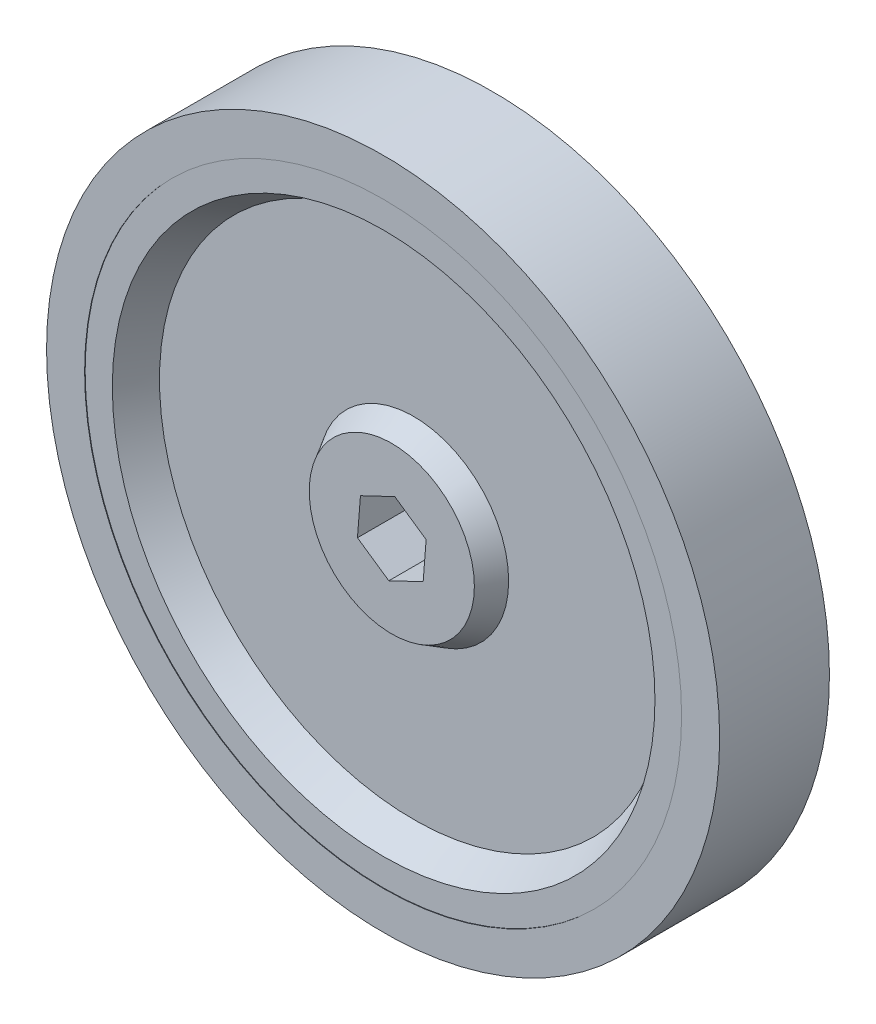
ISO-10303-21;
HEADER;
FILE_DESCRIPTION(('STEP AP214'),'2;1');
FILE_NAME('part.step','',(''),(''),'','','');
FILE_SCHEMA(('AUTOMOTIVE_DESIGN { 1 0 10303 214 1 1 1 1 }'));
ENDSEC;
DATA;
#1=APPLICATION_CONTEXT('core data for automotive mechanical design processes');
#2=APPLICATION_PROTOCOL_DEFINITION('international standard','automotive_design',2000,#1);
#3=PRODUCT_CONTEXT('',#1,'mechanical');
#4=PRODUCT('Part','Part','',(#3));
#5=PRODUCT_RELATED_PRODUCT_CATEGORY('part','',(#4));
#6=PRODUCT_DEFINITION_FORMATION('','',#4);
#7=PRODUCT_DEFINITION_CONTEXT('part definition',#1,'design');
#8=PRODUCT_DEFINITION('design','',#6,#7);
#9=PRODUCT_DEFINITION_SHAPE('','',#8);
#10=(LENGTH_UNIT() NAMED_UNIT(*) SI_UNIT(.MILLI.,.METRE.));
#11=(NAMED_UNIT(*) PLANE_ANGLE_UNIT() SI_UNIT($,.RADIAN.));
#12=(NAMED_UNIT(*) SI_UNIT($,.STERADIAN.) SOLID_ANGLE_UNIT());
#13=UNCERTAINTY_MEASURE_WITH_UNIT(LENGTH_MEASURE(1.E-05),#10,'distance_accuracy_value','');
#14=(GEOMETRIC_REPRESENTATION_CONTEXT(3) GLOBAL_UNCERTAINTY_ASSIGNED_CONTEXT((#13)) GLOBAL_UNIT_ASSIGNED_CONTEXT((#10,
#11,#12)) REPRESENTATION_CONTEXT('',''));
#15=CARTESIAN_POINT('',(0.,0.,0.));
#16=DIRECTION('',(0.,0.,1.));
#17=DIRECTION('',(1.,0.,0.));
#18=AXIS2_PLACEMENT_3D('',#15,#16,#17);
#19=CARTESIAN_POINT('',(0.,0.,-4.5));
#20=DIRECTION('',(0.,0.,-1.));
#21=DIRECTION('',(-1.,0.,0.));
#22=AXIS2_PLACEMENT_3D('',#19,#20,#21);
#23=PLANE('',#22);
#24=CARTESIAN_POINT('',(0.,0.,-4.5));
#25=DIRECTION('',(0.,0.,-1.));
#26=DIRECTION('',(-1.,0.,0.));
#27=AXIS2_PLACEMENT_3D('',#24,#25,#26);
#28=CIRCLE('',#27,46.737073519457);
#29=CARTESIAN_POINT('',(-46.737073519457,0.,-4.5));
#30=VERTEX_POINT('',#29);
#31=EDGE_CURVE('E164',#30,#30,#28,.T.);
#32=ORIENTED_EDGE('',*,*,#31,.T.);
#33=EDGE_LOOP('',(#32));
#34=FACE_BOUND('',#33,.T.);
#35=CARTESIAN_POINT('',(0.,0.,-4.5));
#36=DIRECTION('',(0.,0.,-1.));
#37=DIRECTION('',(-1.,0.,0.));
#38=AXIS2_PLACEMENT_3D('',#35,#36,#37);
#39=CIRCLE('',#38,17.5);
#40=CARTESIAN_POINT('',(-17.5,0.,-4.5));
#41=VERTEX_POINT('',#40);
#42=EDGE_CURVE('E149',#41,#41,#39,.T.);
#43=ORIENTED_EDGE('',*,*,#42,.F.);
#44=EDGE_LOOP('',(#43));
#45=FACE_BOUND('',#44,.T.);
#46=ADVANCED_FACE('F46',(#34,#45),#23,.T.);
#47=CARTESIAN_POINT('',(0.,0.,4.5));
#48=DIRECTION('',(0.,0.,1.));
#49=DIRECTION('',(1.,0.,0.));
#50=AXIS2_PLACEMENT_3D('',#47,#48,#49);
#51=PLANE('',#50);
#52=CARTESIAN_POINT('',(0.,0.,4.5));
#53=DIRECTION('',(0.,0.,1.));
#54=DIRECTION('',(1.,0.,0.));
#55=AXIS2_PLACEMENT_3D('',#52,#53,#54);
#56=CIRCLE('',#55,46.737073519457);
#57=CARTESIAN_POINT('',(46.737073519457,0.,4.5));
#58=VERTEX_POINT('',#57);
#59=EDGE_CURVE('E54',#58,#58,#56,.T.);
#60=ORIENTED_EDGE('',*,*,#59,.T.);
#61=EDGE_LOOP('',(#60));
#62=FACE_BOUND('',#61,.T.);
#63=CARTESIAN_POINT('',(0.,0.,4.5));
#64=DIRECTION('',(0.,0.,1.));
#65=DIRECTION('',(1.,0.,0.));
#66=AXIS2_PLACEMENT_3D('',#63,#64,#65);
#67=CIRCLE('',#66,17.5);
#68=CARTESIAN_POINT('',(17.5,0.,4.5));
#69=VERTEX_POINT('',#68);
#70=EDGE_CURVE('E155',#69,#69,#67,.T.);
#71=ORIENTED_EDGE('',*,*,#70,.F.);
#72=EDGE_LOOP('',(#71));
#73=FACE_BOUND('',#72,.T.);
#74=ADVANCED_FACE('F172',(#62,#73),#51,.T.);
#75=CARTESIAN_POINT('',(0.,0.,10.));
#76=DIRECTION('',(0.,0.,-1.));
#77=DIRECTION('',(-1.,0.,0.));
#78=AXIS2_PLACEMENT_3D('',#75,#76,#77);
#79=CYLINDRICAL_SURFACE('',#78,61.9125);
#80=CARTESIAN_POINT('',(0.,0.,10.1));
#81=DIRECTION('',(0.,0.,1.));
#82=DIRECTION('',(1.,0.,0.));
#83=AXIS2_PLACEMENT_3D('',#80,#81,#82);
#84=CIRCLE('',#83,61.9125);
#85=CARTESIAN_POINT('',(61.9125,0.,10.1));
#86=VERTEX_POINT('',#85);
#87=EDGE_CURVE('E287',#86,#86,#84,.T.);
#88=ORIENTED_EDGE('',*,*,#87,.F.);
#89=EDGE_LOOP('',(#88));
#90=FACE_BOUND('',#89,.T.);
#91=CARTESIAN_POINT('',(0.,0.,-10.1));
#92=DIRECTION('',(0.,0.,-1.));
#93=DIRECTION('',(-1.,0.,0.));
#94=AXIS2_PLACEMENT_3D('',#91,#92,#93);
#95=CIRCLE('',#94,61.9125);
#96=CARTESIAN_POINT('',(-61.9125,0.,-10.1));
#97=VERTEX_POINT('',#96);
#98=EDGE_CURVE('E279',#97,#97,#95,.T.);
#99=ORIENTED_EDGE('',*,*,#98,.F.);
#100=EDGE_LOOP('',(#99));
#101=FACE_BOUND('',#100,.T.);
#102=ADVANCED_FACE('F48',(#90,#101),#79,.T.);
#103=CARTESIAN_POINT('',(0.,0.,10.));
#104=DIRECTION('',(0.,0.,1.));
#105=DIRECTION('',(1.,0.,0.));
#106=AXIS2_PLACEMENT_3D('',#103,#104,#105);
#107=PLANE('',#106);
#108=CARTESIAN_POINT('',(0.,0.,10.));
#109=DIRECTION('',(0.,0.,1.));
#110=DIRECTION('',(1.,0.,0.));
#111=AXIS2_PLACEMENT_3D('',#108,#109,#110);
#112=CIRCLE('',#111,54.9125);
#113=CARTESIAN_POINT('',(54.9125,0.,10.));
#114=VERTEX_POINT('',#113);
#115=EDGE_CURVE('E12',#114,#114,#112,.F.);
#116=ORIENTED_EDGE('',*,*,#115,.F.);
#117=EDGE_LOOP('',(#116));
#118=FACE_BOUND('',#117,.T.);
#119=CARTESIAN_POINT('',(0.,0.,10.));
#120=DIRECTION('',(0.,0.,1.));
#121=DIRECTION('',(1.,0.,0.));
#122=AXIS2_PLACEMENT_3D('',#119,#120,#121);
#123=CIRCLE('',#122,49.9125);
#124=CARTESIAN_POINT('',(49.9125,0.,10.));
#125=VERTEX_POINT('',#124);
#126=EDGE_CURVE('E167',#125,#125,#123,.T.);
#127=ORIENTED_EDGE('',*,*,#126,.F.);
#128=EDGE_LOOP('',(#127));
#129=FACE_BOUND('',#128,.T.);
#130=ADVANCED_FACE('F183',(#118,#129),#107,.T.);
#131=CARTESIAN_POINT('',(0.,0.,-10.));
#132=DIRECTION('',(0.,0.,1.));
#133=DIRECTION('',(1.,0.,0.));
#134=AXIS2_PLACEMENT_3D('',#131,#132,#133);
#135=PLANE('',#134);
#136=CARTESIAN_POINT('',(0.,0.,-10.));
#137=DIRECTION('',(0.,0.,-1.));
#138=DIRECTION('',(-1.,0.,0.));
#139=AXIS2_PLACEMENT_3D('',#136,#137,#138);
#140=CIRCLE('',#139,54.9125);
#141=CARTESIAN_POINT('',(-54.9125,0.,-10.));
#142=VERTEX_POINT('',#141);
#143=EDGE_CURVE('E277',#142,#142,#140,.T.);
#144=ORIENTED_EDGE('',*,*,#143,.T.);
#145=EDGE_LOOP('',(#144));
#146=FACE_BOUND('',#145,.T.);
#147=CARTESIAN_POINT('',(0.,0.,-10.));
#148=DIRECTION('',(0.,0.,-1.));
#149=DIRECTION('',(-1.,0.,0.));
#150=AXIS2_PLACEMENT_3D('',#147,#148,#149);
#151=CIRCLE('',#150,49.9125);
#152=CARTESIAN_POINT('',(-49.9125,0.,-10.));
#153=VERTEX_POINT('',#152);
#154=EDGE_CURVE('E161',#153,#153,#151,.T.);
#155=ORIENTED_EDGE('',*,*,#154,.F.);
#156=EDGE_LOOP('',(#155));
#157=FACE_BOUND('',#156,.T.);
#158=ADVANCED_FACE('F179',(#146,#157),#135,.F.);
#159=CARTESIAN_POINT('',(0.,0.,10.));
#160=DIRECTION('',(0.,0.,1.));
#161=DIRECTION('',(1.,0.,0.));
#162=AXIS2_PLACEMENT_3D('',#159,#160,#161);
#163=CONICAL_SURFACE('',#162,49.9125,0.5235987755983);
#164=ORIENTED_EDGE('',*,*,#59,.F.);
#165=EDGE_LOOP('',(#164));
#166=FACE_BOUND('',#165,.T.);
#167=ORIENTED_EDGE('',*,*,#126,.T.);
#168=EDGE_LOOP('',(#167));
#169=FACE_BOUND('',#168,.T.);
#170=ADVANCED_FACE('F175',(#166,#169),#163,.F.);
#171=CARTESIAN_POINT('',(0.,0.,-10.));
#172=DIRECTION('',(0.,0.,-1.));
#173=DIRECTION('',(-1.,0.,0.));
#174=AXIS2_PLACEMENT_3D('',#171,#172,#173);
#175=CONICAL_SURFACE('',#174,49.9125,0.5235987755983);
#176=ORIENTED_EDGE('',*,*,#31,.F.);
#177=EDGE_LOOP('',(#176));
#178=FACE_BOUND('',#177,.T.);
#179=ORIENTED_EDGE('',*,*,#154,.T.);
#180=EDGE_LOOP('',(#179));
#181=FACE_BOUND('',#180,.T.);
#182=ADVANCED_FACE('F178',(#178,#181),#175,.F.);
#183=CARTESIAN_POINT('',(0.,0.,4.5));
#184=DIRECTION('',(0.,0.,-1.));
#185=DIRECTION('',(1.,0.,0.));
#186=AXIS2_PLACEMENT_3D('',#183,#184,#185);
#187=CONICAL_SURFACE('',#186,17.5,0.5235987755983);
#188=CARTESIAN_POINT('',(0.,0.,8.5));
#189=DIRECTION('',(0.,0.,1.));
#190=DIRECTION('',(1.,0.,0.));
#191=AXIS2_PLACEMENT_3D('',#188,#189,#190);
#192=CIRCLE('',#191,15.1905989232415);
#193=CARTESIAN_POINT('',(15.1905989232415,0.,8.5));
#194=VERTEX_POINT('',#193);
#195=EDGE_CURVE('E158',#194,#194,#192,.T.);
#196=ORIENTED_EDGE('',*,*,#195,.F.);
#197=EDGE_LOOP('',(#196));
#198=FACE_BOUND('',#197,.T.);
#199=ORIENTED_EDGE('',*,*,#70,.T.);
#200=EDGE_LOOP('',(#199));
#201=FACE_BOUND('',#200,.T.);
#202=ADVANCED_FACE('F204',(#198,#201),#187,.T.);
#203=CARTESIAN_POINT('',(0.,0.,8.5));
#204=DIRECTION('',(0.,0.,1.));
#205=DIRECTION('',(1.,0.,0.));
#206=AXIS2_PLACEMENT_3D('',#203,#204,#205);
#207=PLANE('',#206);
#208=DIRECTION('',(0.824168192044815,-0.56634511671028,0.));
#209=VECTOR('',#208,1.);
#210=CARTESIAN_POINT('',(-3.43328480866256,-4.99625413911331,8.5));
#211=LINE('',#210,#209);
#212=CARTESIAN_POINT('',(-6.31787348081941,-3.01404623062733,8.5));
#213=VERTEX_POINT('',#212);
#214=CARTESIAN_POINT('',(-0.548696136505699,-6.9784620475993,8.5));
#215=VERTEX_POINT('',#214);
#216=EDGE_CURVE('E147',#213,#215,#211,.T.);
#217=ORIENTED_EDGE('',*,*,#216,.F.);
#218=DIRECTION('',(-0.0783851623579575,-0.996923149657042,0.));
#219=VECTOR('',#218,1.);
#220=CARTESIAN_POINT('',(-6.04352541256656,0.475184793172313,8.5));
#221=LINE('',#220,#219);
#222=CARTESIAN_POINT('',(-5.76917734431371,3.96441581697196,8.5));
#223=VERTEX_POINT('',#222);
#224=EDGE_CURVE('E132',#223,#213,#221,.T.);
#225=ORIENTED_EDGE('',*,*,#224,.F.);
#226=DIRECTION('',(-0.902553354402773,-0.430578032946762,0.));
#227=VECTOR('',#226,1.);
#228=CARTESIAN_POINT('',(-2.61024060390401,5.47143893228563,8.5));
#229=LINE('',#228,#227);
#230=CARTESIAN_POINT('',(0.5486961365057,6.9784620475993,8.5));
#231=VERTEX_POINT('',#230);
#232=EDGE_CURVE('E105',#231,#223,#229,.T.);
#233=ORIENTED_EDGE('',*,*,#232,.F.);
#234=DIRECTION('',(-0.824168192044815,0.56634511671028,0.));
#235=VECTOR('',#234,1.);
#236=CARTESIAN_POINT('',(3.43328480866256,4.99625413911332,8.5));
#237=LINE('',#236,#235);
#238=CARTESIAN_POINT('',(6.31787348081941,3.01404623062734,8.5));
#239=VERTEX_POINT('',#238);
#240=EDGE_CURVE('E141',#239,#231,#237,.T.);
#241=ORIENTED_EDGE('',*,*,#240,.F.);
#242=DIRECTION('',(0.0783851623579574,0.996923149657042,0.));
#243=VECTOR('',#242,1.);
#244=CARTESIAN_POINT('',(6.04352541256656,-0.475184793172312,8.5));
#245=LINE('',#244,#243);
#246=CARTESIAN_POINT('',(5.76917734431371,-3.96441581697196,8.5));
#247=VERTEX_POINT('',#246);
#248=EDGE_CURVE('E143',#247,#239,#245,.T.);
#249=ORIENTED_EDGE('',*,*,#248,.F.);
#250=DIRECTION('',(0.902553354402773,0.430578032946762,0.));
#251=VECTOR('',#250,1.);
#252=CARTESIAN_POINT('',(2.61024060390401,-5.47143893228563,8.5));
#253=LINE('',#252,#251);
#254=EDGE_CURVE('E145',#215,#247,#253,.T.);
#255=ORIENTED_EDGE('',*,*,#254,.F.);
#256=EDGE_LOOP('',(#217,#225,#233,#241,#249,#255));
#257=FACE_BOUND('',#256,.T.);
#258=ORIENTED_EDGE('',*,*,#195,.T.);
#259=EDGE_LOOP('',(#258));
#260=FACE_BOUND('',#259,.T.);
#261=ADVANCED_FACE('F211',(#257,#260),#207,.T.);
#262=CARTESIAN_POINT('',(0.,0.,-4.5));
#263=DIRECTION('',(0.,0.,1.));
#264=DIRECTION('',(-1.,0.,0.));
#265=AXIS2_PLACEMENT_3D('',#262,#263,#264);
#266=CONICAL_SURFACE('',#265,17.5,0.5235987755983);
#267=CARTESIAN_POINT('',(0.,0.,-8.5));
#268=DIRECTION('',(0.,0.,-1.));
#269=DIRECTION('',(-1.,0.,0.));
#270=AXIS2_PLACEMENT_3D('',#267,#268,#269);
#271=CIRCLE('',#270,15.1905989232415);
#272=CARTESIAN_POINT('',(-15.1905989232415,0.,-8.5));
#273=VERTEX_POINT('',#272);
#274=EDGE_CURVE('E152',#273,#273,#271,.T.);
#275=ORIENTED_EDGE('',*,*,#274,.F.);
#276=EDGE_LOOP('',(#275));
#277=FACE_BOUND('',#276,.T.);
#278=ORIENTED_EDGE('',*,*,#42,.T.);
#279=EDGE_LOOP('',(#278));
#280=FACE_BOUND('',#279,.T.);
#281=ADVANCED_FACE('F220',(#277,#280),#266,.T.);
#282=CARTESIAN_POINT('',(0.,0.,-8.5));
#283=DIRECTION('',(0.,0.,-1.));
#284=DIRECTION('',(-1.,0.,0.));
#285=AXIS2_PLACEMENT_3D('',#282,#283,#284);
#286=PLANE('',#285);
#287=DIRECTION('',(-0.824168192044815,0.56634511671028,0.));
#288=VECTOR('',#287,1.);
#289=CARTESIAN_POINT('',(-0.548696136505699,-6.9784620475993,-8.5));
#290=LINE('',#289,#288);
#291=CARTESIAN_POINT('',(-0.548696136505699,-6.9784620475993,-8.5));
#292=VERTEX_POINT('',#291);
#293=CARTESIAN_POINT('',(-6.31787348081941,-3.01404623062733,-8.5));
#294=VERTEX_POINT('',#293);
#295=EDGE_CURVE('E69',#292,#294,#290,.T.);
#296=ORIENTED_EDGE('',*,*,#295,.F.);
#297=DIRECTION('',(-0.902553354402773,-0.430578032946762,0.));
#298=VECTOR('',#297,1.);
#299=CARTESIAN_POINT('',(5.76917734431371,-3.96441581697196,-8.5));
#300=LINE('',#299,#298);
#301=CARTESIAN_POINT('',(5.76917734431371,-3.96441581697196,-8.5));
#302=VERTEX_POINT('',#301);
#303=EDGE_CURVE('E127',#302,#292,#300,.T.);
#304=ORIENTED_EDGE('',*,*,#303,.F.);
#305=DIRECTION('',(-0.0783851623579574,-0.996923149657042,0.));
#306=VECTOR('',#305,1.);
#307=CARTESIAN_POINT('',(6.31787348081941,3.01404623062734,-8.5));
#308=LINE('',#307,#306);
#309=CARTESIAN_POINT('',(6.31787348081941,3.01404623062734,-8.5));
#310=VERTEX_POINT('',#309);
#311=EDGE_CURVE('E121',#310,#302,#308,.T.);
#312=ORIENTED_EDGE('',*,*,#311,.F.);
#313=DIRECTION('',(0.824168192044815,-0.56634511671028,0.));
#314=VECTOR('',#313,1.);
#315=CARTESIAN_POINT('',(0.5486961365057,6.9784620475993,-8.5));
#316=LINE('',#315,#314);
#317=CARTESIAN_POINT('',(0.5486961365057,6.9784620475993,-8.5));
#318=VERTEX_POINT('',#317);
#319=EDGE_CURVE('E119',#318,#310,#316,.T.);
#320=ORIENTED_EDGE('',*,*,#319,.F.);
#321=DIRECTION('',(0.902553354402773,0.430578032946762,0.));
#322=VECTOR('',#321,1.);
#323=CARTESIAN_POINT('',(-5.76917734431371,3.96441581697196,-8.5));
#324=LINE('',#323,#322);
#325=CARTESIAN_POINT('',(-5.76917734431371,3.96441581697196,-8.5));
#326=VERTEX_POINT('',#325);
#327=EDGE_CURVE('E102',#326,#318,#324,.T.);
#328=ORIENTED_EDGE('',*,*,#327,.F.);
#329=DIRECTION('',(0.0783851623579575,0.996923149657042,0.));
#330=VECTOR('',#329,1.);
#331=CARTESIAN_POINT('',(-6.31787348081941,-3.01404623062733,-8.5));
#332=LINE('',#331,#330);
#333=EDGE_CURVE('E111',#294,#326,#332,.T.);
#334=ORIENTED_EDGE('',*,*,#333,.F.);
#335=EDGE_LOOP('',(#296,#304,#312,#320,#328,#334));
#336=FACE_BOUND('',#335,.T.);
#337=ORIENTED_EDGE('',*,*,#274,.T.);
#338=EDGE_LOOP('',(#337));
#339=FACE_BOUND('',#338,.T.);
#340=ADVANCED_FACE('F115',(#336,#339),#286,.T.);
#341=CARTESIAN_POINT('',(-0.548696136505699,-6.9784620475993,15.5));
#342=DIRECTION('',(-0.56634511671028,-0.824168192044815,0.));
#343=DIRECTION('',(0.824168192044815,-0.56634511671028,0.));
#344=AXIS2_PLACEMENT_3D('',#341,#342,#343);
#345=PLANE('',#344);
#346=ORIENTED_EDGE('',*,*,#216,.T.);
#347=DIRECTION('',(0.,0.,-1.));
#348=VECTOR('',#347,1.);
#349=CARTESIAN_POINT('',(-0.548696136505699,-6.9784620475993,15.5));
#350=LINE('',#349,#348);
#351=EDGE_CURVE('E130',#215,#292,#350,.T.);
#352=ORIENTED_EDGE('',*,*,#351,.T.);
#353=ORIENTED_EDGE('',*,*,#295,.T.);
#354=DIRECTION('',(0.,0.,-1.));
#355=VECTOR('',#354,1.);
#356=CARTESIAN_POINT('',(-6.31787348081941,-3.01404623062733,15.5));
#357=LINE('',#356,#355);
#358=EDGE_CURVE('E108',#213,#294,#357,.T.);
#359=ORIENTED_EDGE('',*,*,#358,.F.);
#360=EDGE_LOOP('',(#346,#352,#353,#359));
#361=FACE_BOUND('',#360,.T.);
#362=ADVANCED_FACE('F235',(#361),#345,.F.);
#363=CARTESIAN_POINT('',(5.76917734431371,-3.96441581697196,15.5));
#364=DIRECTION('',(0.430578032946762,-0.902553354402773,0.));
#365=DIRECTION('',(0.902553354402773,0.430578032946762,0.));
#366=AXIS2_PLACEMENT_3D('',#363,#364,#365);
#367=PLANE('',#366);
#368=ORIENTED_EDGE('',*,*,#254,.T.);
#369=DIRECTION('',(0.,0.,-1.));
#370=VECTOR('',#369,1.);
#371=CARTESIAN_POINT('',(5.76917734431371,-3.96441581697196,15.5));
#372=LINE('',#371,#370);
#373=EDGE_CURVE('E133',#247,#302,#372,.T.);
#374=ORIENTED_EDGE('',*,*,#373,.T.);
#375=ORIENTED_EDGE('',*,*,#303,.T.);
#376=ORIENTED_EDGE('',*,*,#351,.F.);
#377=EDGE_LOOP('',(#368,#374,#375,#376));
#378=FACE_BOUND('',#377,.T.);
#379=ADVANCED_FACE('F238',(#378),#367,.F.);
#380=CARTESIAN_POINT('',(6.31787348081941,3.01404623062734,15.5));
#381=DIRECTION('',(0.996923149657042,-0.0783851623579574,0.));
#382=DIRECTION('',(0.0783851623579574,0.996923149657042,0.));
#383=AXIS2_PLACEMENT_3D('',#380,#381,#382);
#384=PLANE('',#383);
#385=ORIENTED_EDGE('',*,*,#248,.T.);
#386=DIRECTION('',(0.,0.,-1.));
#387=VECTOR('',#386,1.);
#388=CARTESIAN_POINT('',(6.31787348081941,3.01404623062734,15.5));
#389=LINE('',#388,#387);
#390=EDGE_CURVE('E135',#239,#310,#389,.T.);
#391=ORIENTED_EDGE('',*,*,#390,.T.);
#392=ORIENTED_EDGE('',*,*,#311,.T.);
#393=ORIENTED_EDGE('',*,*,#373,.F.);
#394=EDGE_LOOP('',(#385,#391,#392,#393));
#395=FACE_BOUND('',#394,.T.);
#396=ADVANCED_FACE('F247',(#395),#384,.F.);
#397=CARTESIAN_POINT('',(0.5486961365057,6.9784620475993,15.5));
#398=DIRECTION('',(0.56634511671028,0.824168192044815,0.));
#399=DIRECTION('',(-0.824168192044815,0.56634511671028,0.));
#400=AXIS2_PLACEMENT_3D('',#397,#398,#399);
#401=PLANE('',#400);
#402=ORIENTED_EDGE('',*,*,#240,.T.);
#403=DIRECTION('',(0.,0.,-1.));
#404=VECTOR('',#403,1.);
#405=CARTESIAN_POINT('',(0.5486961365057,6.9784620475993,15.5));
#406=LINE('',#405,#404);
#407=EDGE_CURVE('E107',#231,#318,#406,.T.);
#408=ORIENTED_EDGE('',*,*,#407,.T.);
#409=ORIENTED_EDGE('',*,*,#319,.T.);
#410=ORIENTED_EDGE('',*,*,#390,.F.);
#411=EDGE_LOOP('',(#402,#408,#409,#410));
#412=FACE_BOUND('',#411,.T.);
#413=ADVANCED_FACE('F244',(#412),#401,.F.);
#414=CARTESIAN_POINT('',(-5.76917734431371,3.96441581697196,15.5));
#415=DIRECTION('',(-0.430578032946762,0.902553354402773,0.));
#416=DIRECTION('',(-0.902553354402773,-0.430578032946762,0.));
#417=AXIS2_PLACEMENT_3D('',#414,#415,#416);
#418=PLANE('',#417);
#419=ORIENTED_EDGE('',*,*,#232,.T.);
#420=DIRECTION('',(0.,0.,-1.));
#421=VECTOR('',#420,1.);
#422=CARTESIAN_POINT('',(-5.76917734431371,3.96441581697196,15.5));
#423=LINE('',#422,#421);
#424=EDGE_CURVE('E61',#223,#326,#423,.T.);
#425=ORIENTED_EDGE('',*,*,#424,.T.);
#426=ORIENTED_EDGE('',*,*,#327,.T.);
#427=ORIENTED_EDGE('',*,*,#407,.F.);
#428=EDGE_LOOP('',(#419,#425,#426,#427));
#429=FACE_BOUND('',#428,.T.);
#430=ADVANCED_FACE('F99',(#429),#418,.F.);
#431=CARTESIAN_POINT('',(-6.31787348081941,-3.01404623062733,15.5));
#432=DIRECTION('',(-0.996923149657042,0.0783851623579575,0.));
#433=DIRECTION('',(-0.0783851623579575,-0.996923149657042,0.));
#434=AXIS2_PLACEMENT_3D('',#431,#432,#433);
#435=PLANE('',#434);
#436=ORIENTED_EDGE('',*,*,#224,.T.);
#437=ORIENTED_EDGE('',*,*,#358,.T.);
#438=ORIENTED_EDGE('',*,*,#333,.T.);
#439=ORIENTED_EDGE('',*,*,#424,.F.);
#440=EDGE_LOOP('',(#436,#437,#438,#439));
#441=FACE_BOUND('',#440,.T.);
#442=ADVANCED_FACE('F112',(#441),#435,.F.);
#443=CARTESIAN_POINT('',(0.,0.,10.1));
#444=DIRECTION('',(0.,0.,1.));
#445=DIRECTION('',(1.,0.,0.));
#446=AXIS2_PLACEMENT_3D('',#443,#444,#445);
#447=PLANE('',#446);
#448=ORIENTED_EDGE('',*,*,#87,.T.);
#449=EDGE_LOOP('',(#448));
#450=FACE_BOUND('',#449,.T.);
#451=CARTESIAN_POINT('',(0.,0.,10.1));
#452=DIRECTION('',(0.,0.,1.));
#453=DIRECTION('',(1.,0.,0.));
#454=AXIS2_PLACEMENT_3D('',#451,#452,#453);
#455=CIRCLE('',#454,54.9125);
#456=CARTESIAN_POINT('',(54.9125,0.,10.1));
#457=VERTEX_POINT('',#456);
#458=EDGE_CURVE('E284',#457,#457,#455,.T.);
#459=ORIENTED_EDGE('',*,*,#458,.F.);
#460=EDGE_LOOP('',(#459));
#461=FACE_BOUND('',#460,.T.);
#462=ADVANCED_FACE('F241',(#450,#461),#447,.T.);
#463=CARTESIAN_POINT('',(0.,0.,10.1));
#464=DIRECTION('',(0.,0.,-1.));
#465=DIRECTION('',(-1.,0.,0.));
#466=AXIS2_PLACEMENT_3D('',#463,#464,#465);
#467=CYLINDRICAL_SURFACE('',#466,54.9125);
#468=ORIENTED_EDGE('',*,*,#458,.T.);
#469=EDGE_LOOP('',(#468));
#470=FACE_BOUND('',#469,.T.);
#471=ORIENTED_EDGE('',*,*,#115,.T.);
#472=EDGE_LOOP('',(#471));
#473=FACE_BOUND('',#472,.T.);
#474=ADVANCED_FACE('F257',(#470,#473),#467,.F.);
#475=CARTESIAN_POINT('',(0.,0.,-10.1));
#476=DIRECTION('',(0.,0.,-1.));
#477=DIRECTION('',(-1.,0.,0.));
#478=AXIS2_PLACEMENT_3D('',#475,#476,#477);
#479=PLANE('',#478);
#480=ORIENTED_EDGE('',*,*,#98,.T.);
#481=EDGE_LOOP('',(#480));
#482=FACE_BOUND('',#481,.T.);
#483=CARTESIAN_POINT('',(0.,0.,-10.1));
#484=DIRECTION('',(0.,0.,-1.));
#485=DIRECTION('',(-1.,0.,0.));
#486=AXIS2_PLACEMENT_3D('',#483,#484,#485);
#487=CIRCLE('',#486,54.9125);
#488=CARTESIAN_POINT('',(-54.9125,0.,-10.1));
#489=VERTEX_POINT('',#488);
#490=EDGE_CURVE('E274',#489,#489,#487,.T.);
#491=ORIENTED_EDGE('',*,*,#490,.F.);
#492=EDGE_LOOP('',(#491));
#493=FACE_BOUND('',#492,.T.);
#494=ADVANCED_FACE('F261',(#482,#493),#479,.T.);
#495=CARTESIAN_POINT('',(0.,0.,-10.1));
#496=DIRECTION('',(0.,0.,1.));
#497=DIRECTION('',(1.,0.,0.));
#498=AXIS2_PLACEMENT_3D('',#495,#496,#497);
#499=CYLINDRICAL_SURFACE('',#498,54.9125);
#500=ORIENTED_EDGE('',*,*,#490,.T.);
#501=EDGE_LOOP('',(#500));
#502=FACE_BOUND('',#501,.T.);
#503=ORIENTED_EDGE('',*,*,#143,.F.);
#504=EDGE_LOOP('',(#503));
#505=FACE_BOUND('',#504,.T.);
#506=ADVANCED_FACE('F265',(#502,#505),#499,.F.);
#507=CLOSED_SHELL('',(#46,#74,#102,#130,#158,#170,#182,#202,#261,#281,#340,#362,#379,#396,#413,
#430,#442,#462,#474,#494,#506));
#508=MANIFOLD_SOLID_BREP('B2',#507);
#509=ADVANCED_BREP_SHAPE_REPRESENTATION('',(#18,#508),#14);
#510=SHAPE_DEFINITION_REPRESENTATION(#9,#509);
ENDSEC;
END-ISO-10303-21;
